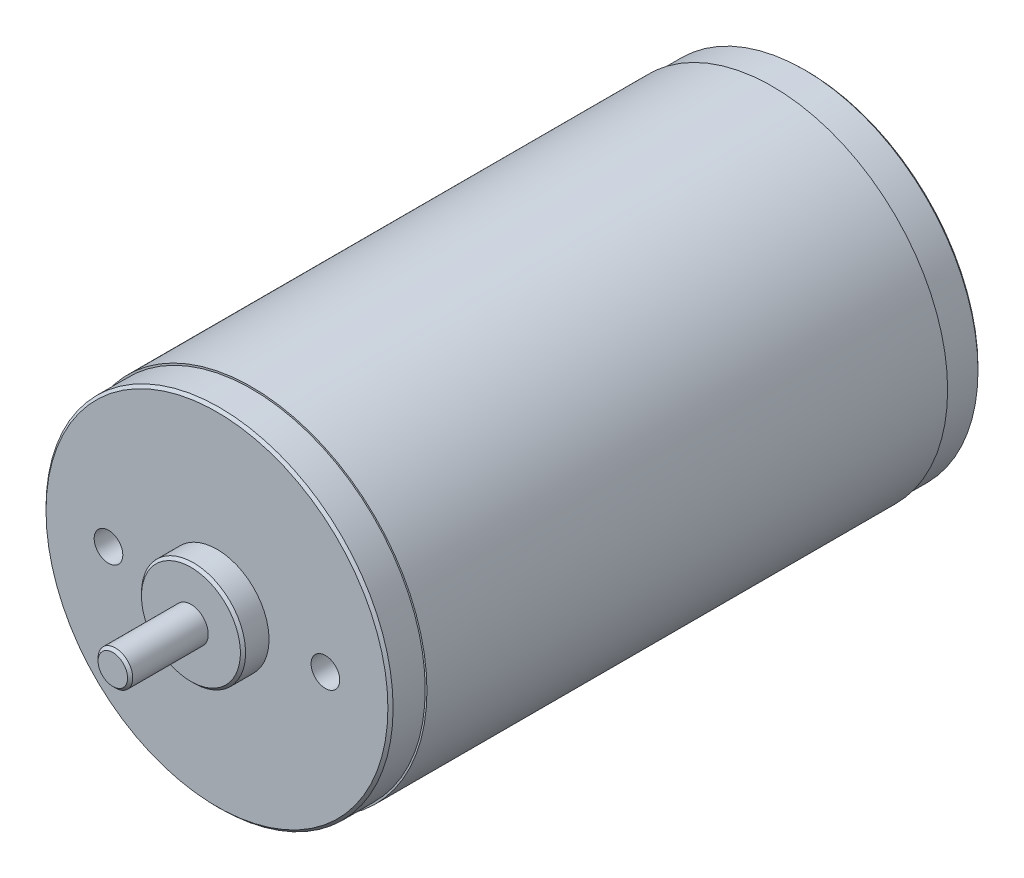
ISO-10303-21;
HEADER;
FILE_DESCRIPTION(('STEP AP214'),'2;1');
FILE_NAME('part.step','',(''),(''),'','','');
FILE_SCHEMA(('AUTOMOTIVE_DESIGN { 1 0 10303 214 1 1 1 1 }'));
ENDSEC;
DATA;
#1=APPLICATION_CONTEXT('core data for automotive mechanical design processes');
#2=APPLICATION_PROTOCOL_DEFINITION('international standard','automotive_design',2000,#1);
#3=PRODUCT_CONTEXT('',#1,'mechanical');
#4=PRODUCT('Part','Part','',(#3));
#5=PRODUCT_RELATED_PRODUCT_CATEGORY('part','',(#4));
#6=PRODUCT_DEFINITION_FORMATION('','',#4);
#7=PRODUCT_DEFINITION_CONTEXT('part definition',#1,'design');
#8=PRODUCT_DEFINITION('design','',#6,#7);
#9=PRODUCT_DEFINITION_SHAPE('','',#8);
#10=(LENGTH_UNIT() NAMED_UNIT(*) SI_UNIT(.MILLI.,.METRE.));
#11=(NAMED_UNIT(*) PLANE_ANGLE_UNIT() SI_UNIT($,.RADIAN.));
#12=(NAMED_UNIT(*) SI_UNIT($,.STERADIAN.) SOLID_ANGLE_UNIT());
#13=UNCERTAINTY_MEASURE_WITH_UNIT(LENGTH_MEASURE(1.E-05),#10,'distance_accuracy_value','');
#14=(GEOMETRIC_REPRESENTATION_CONTEXT(3) GLOBAL_UNCERTAINTY_ASSIGNED_CONTEXT((#13)) GLOBAL_UNIT_ASSIGNED_CONTEXT((#10,
#11,#12)) REPRESENTATION_CONTEXT('',''));
#15=CARTESIAN_POINT('',(0.,0.,0.));
#16=DIRECTION('',(0.,0.,1.));
#17=DIRECTION('',(1.,0.,0.));
#18=AXIS2_PLACEMENT_3D('',#15,#16,#17);
#19=CARTESIAN_POINT('',(0.,0.,12.));
#20=DIRECTION('',(0.,0.,1.));
#21=DIRECTION('',(1.,0.,0.));
#22=AXIS2_PLACEMENT_3D('',#19,#20,#21);
#23=PLANE('',#22);
#24=CARTESIAN_POINT('',(0.,0.,12.0000000000573));
#25=DIRECTION('',(0.,0.,-1.));
#26=DIRECTION('',(-1.,0.,0.));
#27=AXIS2_PLACEMENT_3D('',#24,#25,#26);
#28=CIRCLE('',#27,1.70000000002801);
#29=CARTESIAN_POINT('',(-1.70000000002801,0.,12.0000000000573));
#30=VERTEX_POINT('',#29);
#31=EDGE_CURVE('E21',#30,#30,#28,.T.);
#32=ORIENTED_EDGE('',*,*,#31,.F.);
#33=EDGE_LOOP('',(#32));
#34=FACE_BOUND('',#33,.T.);
#35=ADVANCED_FACE('F18',(#34),#23,.T.);
#36=CARTESIAN_POINT('',(0.,0.,11.7000000000758));
#37=DIRECTION('',(0.,0.,-1.));
#38=DIRECTION('',(-1.,0.,0.));
#39=AXIS2_PLACEMENT_3D('',#36,#37,#38);
#40=CONICAL_SURFACE('',#39,2.00000000000955,0.785398163397448);
#41=CARTESIAN_POINT('',(0.,0.,11.7));
#42=DIRECTION('',(0.,0.,-1.));
#43=DIRECTION('',(-1.,0.,0.));
#44=AXIS2_PLACEMENT_3D('',#41,#42,#43);
#45=CIRCLE('',#44,2.);
#46=CARTESIAN_POINT('',(-2.,0.,11.7));
#47=VERTEX_POINT('',#46);
#48=EDGE_CURVE('E54',#47,#47,#45,.T.);
#49=ORIENTED_EDGE('',*,*,#48,.F.);
#50=EDGE_LOOP('',(#49));
#51=FACE_BOUND('',#50,.T.);
#52=ORIENTED_EDGE('',*,*,#31,.T.);
#53=EDGE_LOOP('',(#52));
#54=FACE_BOUND('',#53,.T.);
#55=ADVANCED_FACE('F100',(#51,#54),#40,.T.);
#56=CARTESIAN_POINT('',(0.,0.,12.));
#57=DIRECTION('',(0.,0.,-1.));
#58=DIRECTION('',(-1.,0.,0.));
#59=AXIS2_PLACEMENT_3D('',#56,#57,#58);
#60=CYLINDRICAL_SURFACE('',#59,2.);
#61=CARTESIAN_POINT('',(0.,0.,3.));
#62=DIRECTION('',(0.,0.,-1.));
#63=DIRECTION('',(-1.,0.,0.));
#64=AXIS2_PLACEMENT_3D('',#61,#62,#63);
#65=CIRCLE('',#64,2.);
#66=CARTESIAN_POINT('',(-2.,0.,3.));
#67=VERTEX_POINT('',#66);
#68=EDGE_CURVE('E56',#67,#67,#65,.T.);
#69=ORIENTED_EDGE('',*,*,#68,.F.);
#70=EDGE_LOOP('',(#69));
#71=FACE_BOUND('',#70,.T.);
#72=ORIENTED_EDGE('',*,*,#48,.T.);
#73=EDGE_LOOP('',(#72));
#74=FACE_BOUND('',#73,.T.);
#75=ADVANCED_FACE('F96',(#71,#74),#60,.T.);
#76=CARTESIAN_POINT('',(0.,0.,-69.5));
#77=DIRECTION('',(0.,0.,-1.));
#78=DIRECTION('',(-1.,0.,0.));
#79=AXIS2_PLACEMENT_3D('',#76,#77,#78);
#80=PLANE('',#79);
#81=CARTESIAN_POINT('',(0.,0.,-69.5000000000618));
#82=DIRECTION('',(0.,0.,1.));
#83=DIRECTION('',(1.,0.,0.));
#84=AXIS2_PLACEMENT_3D('',#81,#82,#83);
#85=CIRCLE('',#84,6.02500000002237);
#86=CARTESIAN_POINT('',(6.02500000002237,0.,-69.5000000000618));
#87=VERTEX_POINT('',#86);
#88=EDGE_CURVE('E88',#87,#87,#85,.T.);
#89=ORIENTED_EDGE('',*,*,#88,.F.);
#90=EDGE_LOOP('',(#89));
#91=FACE_BOUND('',#90,.T.);
#92=ADVANCED_FACE('F99',(#91),#80,.T.);
#93=CARTESIAN_POINT('',(0.,0.,3.));
#94=DIRECTION('',(0.,0.,1.));
#95=DIRECTION('',(1.,0.,0.));
#96=AXIS2_PLACEMENT_3D('',#93,#94,#95);
#97=PLANE('',#96);
#98=ORIENTED_EDGE('',*,*,#68,.T.);
#99=EDGE_LOOP('',(#98));
#100=FACE_BOUND('',#99,.T.);
#101=CARTESIAN_POINT('',(0.,0.,2.9999999999859));
#102=DIRECTION('',(0.,0.,-1.));
#103=DIRECTION('',(-1.,0.,0.));
#104=AXIS2_PLACEMENT_3D('',#101,#102,#103);
#105=CIRCLE('',#104,5.70000000004711);
#106=CARTESIAN_POINT('',(-5.70000000004711,0.,2.9999999999859));
#107=VERTEX_POINT('',#106);
#108=EDGE_CURVE('E50',#107,#107,#105,.T.);
#109=ORIENTED_EDGE('',*,*,#108,.F.);
#110=EDGE_LOOP('',(#109));
#111=FACE_BOUND('',#110,.T.);
#112=ADVANCED_FACE('F93',(#100,#111),#97,.T.);
#113=CARTESIAN_POINT('',(0.,0.,-69.2000000000803));
#114=DIRECTION('',(0.,0.,1.));
#115=DIRECTION('',(1.,0.,0.));
#116=AXIS2_PLACEMENT_3D('',#113,#114,#115);
#117=CONICAL_SURFACE('',#116,6.32500000000391,0.785398163397448);
#118=ORIENTED_EDGE('',*,*,#88,.T.);
#119=EDGE_LOOP('',(#118));
#120=FACE_BOUND('',#119,.T.);
#121=CARTESIAN_POINT('',(0.,0.,-69.2));
#122=DIRECTION('',(0.,0.,1.));
#123=DIRECTION('',(1.,0.,0.));
#124=AXIS2_PLACEMENT_3D('',#121,#122,#123);
#125=CIRCLE('',#124,6.325);
#126=CARTESIAN_POINT('',(6.325,0.,-69.2));
#127=VERTEX_POINT('',#126);
#128=EDGE_CURVE('E44',#127,#127,#125,.T.);
#129=ORIENTED_EDGE('',*,*,#128,.F.);
#130=EDGE_LOOP('',(#129));
#131=FACE_BOUND('',#130,.T.);
#132=ADVANCED_FACE('F37',(#120,#131),#117,.T.);
#133=CARTESIAN_POINT('',(-12.5,0.,-8.10000000012678));
#134=DIRECTION('',(0.,0.,1.));
#135=DIRECTION('',(1.,0.,0.));
#136=AXIS2_PLACEMENT_3D('',#133,#134,#135);
#137=CONICAL_SURFACE('',#136,1.6499999998814,1.02974425849465);
#138=CARTESIAN_POINT('',(-12.5000000002728,0.,-9.09142002154795));
#139=VERTEX_POINT('',#138);
#140=VERTEX_LOOP('',#139);
#141=FACE_BOUND('',#140,.T.);
#142=CARTESIAN_POINT('',(-12.5,0.,-8.1));
#143=DIRECTION('',(0.,0.,1.));
#144=DIRECTION('',(1.,0.,0.));
#145=AXIS2_PLACEMENT_3D('',#142,#143,#144);
#146=CIRCLE('',#145,1.65);
#147=CARTESIAN_POINT('',(-10.85,0.,-8.1));
#148=VERTEX_POINT('',#147);
#149=EDGE_CURVE('E41',#148,#148,#146,.T.);
#150=ORIENTED_EDGE('',*,*,#149,.T.);
#151=EDGE_LOOP('',(#150));
#152=FACE_BOUND('',#151,.T.);
#153=ADVANCED_FACE('F33',(#141,#152),#137,.F.);
#154=CARTESIAN_POINT('',(12.5,0.,-8.10000000012678));
#155=DIRECTION('',(0.,0.,1.));
#156=DIRECTION('',(1.,0.,0.));
#157=AXIS2_PLACEMENT_3D('',#154,#155,#156);
#158=CONICAL_SURFACE('',#157,1.64999999985866,1.02974425848248);
#159=CARTESIAN_POINT('',(12.4999999997328,0.,-9.09142002157637));
#160=VERTEX_POINT('',#159);
#161=VERTEX_LOOP('',#160);
#162=FACE_BOUND('',#161,.T.);
#163=CARTESIAN_POINT('',(12.5,0.,-8.1));
#164=DIRECTION('',(0.,0.,1.));
#165=DIRECTION('',(1.,0.,0.));
#166=AXIS2_PLACEMENT_3D('',#163,#164,#165);
#167=CIRCLE('',#166,1.65);
#168=CARTESIAN_POINT('',(14.15,0.,-8.1));
#169=VERTEX_POINT('',#168);
#170=EDGE_CURVE('E43',#169,#169,#167,.T.);
#171=ORIENTED_EDGE('',*,*,#170,.T.);
#172=EDGE_LOOP('',(#171));
#173=FACE_BOUND('',#172,.T.);
#174=ADVANCED_FACE('F36',(#162,#173),#158,.F.);
#175=CARTESIAN_POINT('',(0.,0.,2.70000000000437));
#176=DIRECTION('',(0.,0.,-1.));
#177=DIRECTION('',(-1.,0.,0.));
#178=AXIS2_PLACEMENT_3D('',#175,#176,#177);
#179=CONICAL_SURFACE('',#178,6.00000000002865,0.785398163397448);
#180=CARTESIAN_POINT('',(0.,0.,2.70000000000002));
#181=DIRECTION('',(0.,0.,-1.));
#182=DIRECTION('',(-1.,0.,0.));
#183=AXIS2_PLACEMENT_3D('',#180,#181,#182);
#184=CIRCLE('',#183,6.);
#185=CARTESIAN_POINT('',(-6.,0.,2.70000000000002));
#186=VERTEX_POINT('',#185);
#187=EDGE_CURVE('E47',#186,#186,#184,.T.);
#188=ORIENTED_EDGE('',*,*,#187,.F.);
#189=EDGE_LOOP('',(#188));
#190=FACE_BOUND('',#189,.T.);
#191=ORIENTED_EDGE('',*,*,#108,.T.);
#192=EDGE_LOOP('',(#191));
#193=FACE_BOUND('',#192,.T.);
#194=ADVANCED_FACE('F167',(#190,#193),#179,.T.);
#195=CARTESIAN_POINT('',(0.,0.,-69.5));
#196=DIRECTION('',(0.,0.,1.));
#197=DIRECTION('',(1.,0.,0.));
#198=AXIS2_PLACEMENT_3D('',#195,#196,#197);
#199=CYLINDRICAL_SURFACE('',#198,6.325);
#200=ORIENTED_EDGE('',*,*,#128,.T.);
#201=EDGE_LOOP('',(#200));
#202=FACE_BOUND('',#201,.T.);
#203=CARTESIAN_POINT('',(0.,0.,-68.));
#204=DIRECTION('',(0.,0.,1.));
#205=DIRECTION('',(1.,0.,0.));
#206=AXIS2_PLACEMENT_3D('',#203,#204,#205);
#207=CIRCLE('',#206,6.325);
#208=CARTESIAN_POINT('',(6.325,0.,-68.));
#209=VERTEX_POINT('',#208);
#210=EDGE_CURVE('E83',#209,#209,#207,.F.);
#211=ORIENTED_EDGE('',*,*,#210,.T.);
#212=EDGE_LOOP('',(#211));
#213=FACE_BOUND('',#212,.T.);
#214=ADVANCED_FACE('F163',(#202,#213),#199,.T.);
#215=CARTESIAN_POINT('',(-12.5,0.,0.));
#216=DIRECTION('',(0.,0.,1.));
#217=DIRECTION('',(1.,0.,0.));
#218=AXIS2_PLACEMENT_3D('',#215,#216,#217);
#219=CYLINDRICAL_SURFACE('',#218,1.65);
#220=CARTESIAN_POINT('',(-12.5,0.,0.));
#221=DIRECTION('',(0.,0.,1.));
#222=DIRECTION('',(1.,0.,0.));
#223=AXIS2_PLACEMENT_3D('',#220,#221,#222);
#224=CIRCLE('',#223,1.65);
#225=CARTESIAN_POINT('',(-10.85,0.,0.));
#226=VERTEX_POINT('',#225);
#227=EDGE_CURVE('E80',#226,#226,#224,.F.);
#228=ORIENTED_EDGE('',*,*,#227,.F.);
#229=EDGE_LOOP('',(#228));
#230=FACE_BOUND('',#229,.T.);
#231=ORIENTED_EDGE('',*,*,#149,.F.);
#232=EDGE_LOOP('',(#231));
#233=FACE_BOUND('',#232,.T.);
#234=ADVANCED_FACE('F159',(#230,#233),#219,.F.);
#235=CARTESIAN_POINT('',(12.5,0.,0.));
#236=DIRECTION('',(0.,0.,1.));
#237=DIRECTION('',(1.,0.,0.));
#238=AXIS2_PLACEMENT_3D('',#235,#236,#237);
#239=CYLINDRICAL_SURFACE('',#238,1.65);
#240=CARTESIAN_POINT('',(12.5,0.,0.));
#241=DIRECTION('',(0.,0.,1.));
#242=DIRECTION('',(1.,0.,0.));
#243=AXIS2_PLACEMENT_3D('',#240,#241,#242);
#244=CIRCLE('',#243,1.65);
#245=CARTESIAN_POINT('',(14.15,0.,0.));
#246=VERTEX_POINT('',#245);
#247=EDGE_CURVE('E77',#246,#246,#244,.F.);
#248=ORIENTED_EDGE('',*,*,#247,.F.);
#249=EDGE_LOOP('',(#248));
#250=FACE_BOUND('',#249,.T.);
#251=ORIENTED_EDGE('',*,*,#170,.F.);
#252=EDGE_LOOP('',(#251));
#253=FACE_BOUND('',#252,.T.);
#254=ADVANCED_FACE('F155',(#250,#253),#239,.F.);
#255=CARTESIAN_POINT('',(0.,0.,3.));
#256=DIRECTION('',(0.,0.,-1.));
#257=DIRECTION('',(-1.,0.,0.));
#258=AXIS2_PLACEMENT_3D('',#255,#256,#257);
#259=CYLINDRICAL_SURFACE('',#258,6.);
#260=CARTESIAN_POINT('',(0.,0.,0.));
#261=DIRECTION('',(0.,0.,-1.));
#262=DIRECTION('',(-1.,0.,0.));
#263=AXIS2_PLACEMENT_3D('',#260,#261,#262);
#264=CIRCLE('',#263,6.);
#265=CARTESIAN_POINT('',(-6.,0.,0.));
#266=VERTEX_POINT('',#265);
#267=EDGE_CURVE('E74',#266,#266,#264,.T.);
#268=ORIENTED_EDGE('',*,*,#267,.F.);
#269=EDGE_LOOP('',(#268));
#270=FACE_BOUND('',#269,.T.);
#271=ORIENTED_EDGE('',*,*,#187,.T.);
#272=EDGE_LOOP('',(#271));
#273=FACE_BOUND('',#272,.T.);
#274=ADVANCED_FACE('F151',(#270,#273),#259,.T.);
#275=CARTESIAN_POINT('',(0.,0.,-68.));
#276=DIRECTION('',(0.,0.,1.));
#277=DIRECTION('',(1.,0.,0.));
#278=AXIS2_PLACEMENT_3D('',#275,#276,#277);
#279=PLANE('',#278);
#280=ORIENTED_EDGE('',*,*,#210,.F.);
#281=EDGE_LOOP('',(#280));
#282=FACE_BOUND('',#281,.T.);
#283=CARTESIAN_POINT('',(0.,0.,-68.));
#284=DIRECTION('',(0.,0.,1.));
#285=DIRECTION('',(1.,0.,0.));
#286=AXIS2_PLACEMENT_3D('',#283,#284,#285);
#287=CIRCLE('',#286,19.7);
#288=CARTESIAN_POINT('',(19.7,0.,-68.));
#289=VERTEX_POINT('',#288);
#290=EDGE_CURVE('E71',#289,#289,#287,.T.);
#291=ORIENTED_EDGE('',*,*,#290,.F.);
#292=EDGE_LOOP('',(#291));
#293=FACE_BOUND('',#292,.T.);
#294=ADVANCED_FACE('F147',(#282,#293),#279,.F.);
#295=CARTESIAN_POINT('',(0.,0.,0.));
#296=DIRECTION('',(0.,0.,1.));
#297=DIRECTION('',(1.,0.,0.));
#298=AXIS2_PLACEMENT_3D('',#295,#296,#297);
#299=PLANE('',#298);
#300=ORIENTED_EDGE('',*,*,#267,.T.);
#301=EDGE_LOOP('',(#300));
#302=FACE_BOUND('',#301,.T.);
#303=ORIENTED_EDGE('',*,*,#247,.T.);
#304=EDGE_LOOP('',(#303));
#305=FACE_BOUND('',#304,.T.);
#306=ORIENTED_EDGE('',*,*,#227,.T.);
#307=EDGE_LOOP('',(#306));
#308=FACE_BOUND('',#307,.T.);
#309=CARTESIAN_POINT('',(0.,0.,0.));
#310=DIRECTION('',(0.,0.,-1.));
#311=DIRECTION('',(-1.,0.,0.));
#312=AXIS2_PLACEMENT_3D('',#309,#310,#311);
#313=CIRCLE('',#312,19.7);
#314=CARTESIAN_POINT('',(-19.7,0.,0.));
#315=VERTEX_POINT('',#314);
#316=EDGE_CURVE('E67',#315,#315,#313,.T.);
#317=ORIENTED_EDGE('',*,*,#316,.F.);
#318=EDGE_LOOP('',(#317));
#319=FACE_BOUND('',#318,.T.);
#320=ADVANCED_FACE('F143',(#302,#305,#308,#319),#299,.T.);
#321=CARTESIAN_POINT('',(0.,0.,-67.7));
#322=DIRECTION('',(0.,0.,1.));
#323=DIRECTION('',(1.,0.,0.));
#324=AXIS2_PLACEMENT_3D('',#321,#322,#323);
#325=CONICAL_SURFACE('',#324,20.,0.785398163397466);
#326=ORIENTED_EDGE('',*,*,#290,.T.);
#327=EDGE_LOOP('',(#326));
#328=FACE_BOUND('',#327,.T.);
#329=CARTESIAN_POINT('',(0.,0.,-67.7));
#330=DIRECTION('',(0.,0.,-1.));
#331=DIRECTION('',(-1.,0.,0.));
#332=AXIS2_PLACEMENT_3D('',#329,#330,#331);
#333=CIRCLE('',#332,20.);
#334=CARTESIAN_POINT('',(-20.,0.,-67.7));
#335=VERTEX_POINT('',#334);
#336=EDGE_CURVE('E70',#335,#335,#333,.F.);
#337=ORIENTED_EDGE('',*,*,#336,.F.);
#338=EDGE_LOOP('',(#337));
#339=FACE_BOUND('',#338,.T.);
#340=ADVANCED_FACE('F139',(#328,#339),#325,.T.);
#341=CARTESIAN_POINT('',(0.,0.,-0.299999999999963));
#342=DIRECTION('',(0.,0.,-1.));
#343=DIRECTION('',(-1.,0.,0.));
#344=AXIS2_PLACEMENT_3D('',#341,#342,#343);
#345=CONICAL_SURFACE('',#344,20.,0.785398163397472);
#346=ORIENTED_EDGE('',*,*,#316,.T.);
#347=EDGE_LOOP('',(#346));
#348=FACE_BOUND('',#347,.T.);
#349=CARTESIAN_POINT('',(0.,0.,-0.299999999999964));
#350=DIRECTION('',(0.,0.,1.));
#351=DIRECTION('',(1.,0.,0.));
#352=AXIS2_PLACEMENT_3D('',#349,#350,#351);
#353=CIRCLE('',#352,20.);
#354=CARTESIAN_POINT('',(20.,0.,-0.299999999999964));
#355=VERTEX_POINT('',#354);
#356=EDGE_CURVE('E66',#355,#355,#353,.F.);
#357=ORIENTED_EDGE('',*,*,#356,.F.);
#358=EDGE_LOOP('',(#357));
#359=FACE_BOUND('',#358,.T.);
#360=ADVANCED_FACE('F135',(#348,#359),#345,.T.);
#361=CARTESIAN_POINT('',(0.,0.,-64.));
#362=DIRECTION('',(0.,0.,-1.));
#363=DIRECTION('',(-1.,0.,0.));
#364=AXIS2_PLACEMENT_3D('',#361,#362,#363);
#365=CYLINDRICAL_SURFACE('',#364,20.);
#366=CARTESIAN_POINT('',(0.,0.,-64.));
#367=DIRECTION('',(0.,0.,-1.));
#368=DIRECTION('',(-1.,0.,0.));
#369=AXIS2_PLACEMENT_3D('',#366,#367,#368);
#370=CIRCLE('',#369,20.);
#371=CARTESIAN_POINT('',(-20.,0.,-64.));
#372=VERTEX_POINT('',#371);
#373=EDGE_CURVE('E63',#372,#372,#370,.F.);
#374=ORIENTED_EDGE('',*,*,#373,.F.);
#375=EDGE_LOOP('',(#374));
#376=FACE_BOUND('',#375,.T.);
#377=ORIENTED_EDGE('',*,*,#336,.T.);
#378=EDGE_LOOP('',(#377));
#379=FACE_BOUND('',#378,.T.);
#380=ADVANCED_FACE('F131',(#376,#379),#365,.T.);
#381=CARTESIAN_POINT('',(0.,0.,-4.));
#382=DIRECTION('',(0.,0.,1.));
#383=DIRECTION('',(1.,0.,0.));
#384=AXIS2_PLACEMENT_3D('',#381,#382,#383);
#385=CYLINDRICAL_SURFACE('',#384,20.);
#386=CARTESIAN_POINT('',(0.,0.,-4.));
#387=DIRECTION('',(0.,0.,1.));
#388=DIRECTION('',(1.,0.,0.));
#389=AXIS2_PLACEMENT_3D('',#386,#387,#388);
#390=CIRCLE('',#389,20.);
#391=CARTESIAN_POINT('',(20.,0.,-4.));
#392=VERTEX_POINT('',#391);
#393=EDGE_CURVE('E60',#392,#392,#390,.F.);
#394=ORIENTED_EDGE('',*,*,#393,.F.);
#395=EDGE_LOOP('',(#394));
#396=FACE_BOUND('',#395,.T.);
#397=ORIENTED_EDGE('',*,*,#356,.T.);
#398=EDGE_LOOP('',(#397));
#399=FACE_BOUND('',#398,.T.);
#400=ADVANCED_FACE('F127',(#396,#399),#385,.T.);
#401=CARTESIAN_POINT('',(0.,0.,-64.));
#402=DIRECTION('',(0.,0.,-1.));
#403=DIRECTION('',(-1.,0.,0.));
#404=AXIS2_PLACEMENT_3D('',#401,#402,#403);
#405=PLANE('',#404);
#406=CARTESIAN_POINT('',(0.,0.,-64.));
#407=DIRECTION('',(0.,0.,1.));
#408=DIRECTION('',(1.,0.,0.));
#409=AXIS2_PLACEMENT_3D('',#406,#407,#408);
#410=CIRCLE('',#409,20.2);
#411=CARTESIAN_POINT('',(20.2,0.,-64.));
#412=VERTEX_POINT('',#411);
#413=EDGE_CURVE('E27',#412,#412,#410,.T.);
#414=ORIENTED_EDGE('',*,*,#413,.F.);
#415=EDGE_LOOP('',(#414));
#416=FACE_BOUND('',#415,.T.);
#417=ORIENTED_EDGE('',*,*,#373,.T.);
#418=EDGE_LOOP('',(#417));
#419=FACE_BOUND('',#418,.T.);
#420=ADVANCED_FACE('F120',(#416,#419),#405,.T.);
#421=CARTESIAN_POINT('',(0.,0.,-4.));
#422=DIRECTION('',(0.,0.,1.));
#423=DIRECTION('',(1.,0.,0.));
#424=AXIS2_PLACEMENT_3D('',#421,#422,#423);
#425=PLANE('',#424);
#426=CARTESIAN_POINT('',(0.,0.,-4.));
#427=DIRECTION('',(0.,0.,1.));
#428=DIRECTION('',(1.,0.,0.));
#429=AXIS2_PLACEMENT_3D('',#426,#427,#428);
#430=CIRCLE('',#429,20.2);
#431=CARTESIAN_POINT('',(20.2,0.,-4.));
#432=VERTEX_POINT('',#431);
#433=EDGE_CURVE('E11',#432,#432,#430,.F.);
#434=ORIENTED_EDGE('',*,*,#433,.F.);
#435=EDGE_LOOP('',(#434));
#436=FACE_BOUND('',#435,.T.);
#437=ORIENTED_EDGE('',*,*,#393,.T.);
#438=EDGE_LOOP('',(#437));
#439=FACE_BOUND('',#438,.T.);
#440=ADVANCED_FACE('F114',(#436,#439),#425,.T.);
#441=CARTESIAN_POINT('',(0.,0.,-68.));
#442=DIRECTION('',(0.,0.,1.));
#443=DIRECTION('',(1.,0.,0.));
#444=AXIS2_PLACEMENT_3D('',#441,#442,#443);
#445=CYLINDRICAL_SURFACE('',#444,20.2);
#446=ORIENTED_EDGE('',*,*,#433,.T.);
#447=EDGE_LOOP('',(#446));
#448=FACE_BOUND('',#447,.T.);
#449=ORIENTED_EDGE('',*,*,#413,.T.);
#450=EDGE_LOOP('',(#449));
#451=FACE_BOUND('',#450,.T.);
#452=ADVANCED_FACE('F112',(#448,#451),#445,.T.);
#453=CLOSED_SHELL('',(#35,#55,#75,#92,#112,#132,#153,#174,#194,#214,#234,#254,#274,#294,#320,
#340,#360,#380,#400,#420,#440,#452));
#454=MANIFOLD_SOLID_BREP('B1',#453);
#455=ADVANCED_BREP_SHAPE_REPRESENTATION('',(#18,#454),#14);
#456=SHAPE_DEFINITION_REPRESENTATION(#9,#455);
ENDSEC;
END-ISO-10303-21;
